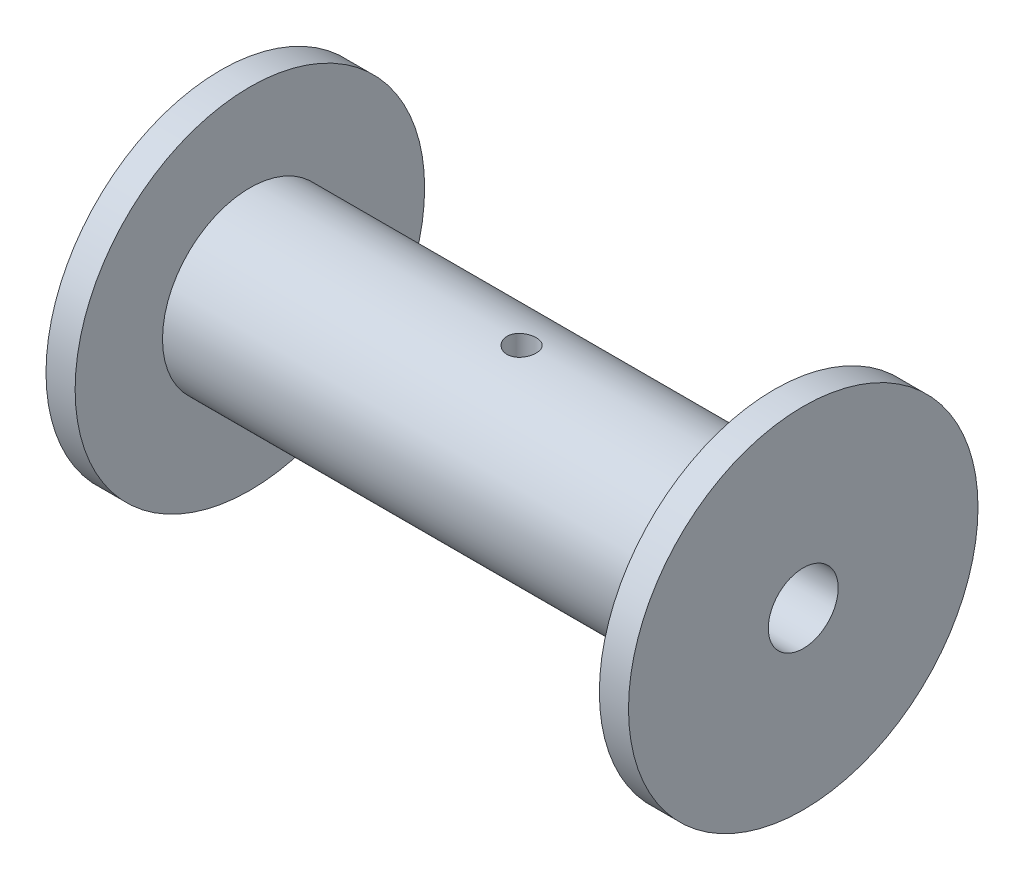
ISO-10303-21;
HEADER;
FILE_DESCRIPTION(('STEP AP214'),'2;1');
FILE_NAME('part.step','',(''),(''),'','','');
FILE_SCHEMA(('AUTOMOTIVE_DESIGN { 1 0 10303 214 1 1 1 1 }'));
ENDSEC;
DATA;
#1=APPLICATION_CONTEXT('core data for automotive mechanical design processes');
#2=APPLICATION_PROTOCOL_DEFINITION('international standard','automotive_design',2000,#1);
#3=PRODUCT_CONTEXT('',#1,'mechanical');
#4=PRODUCT('Part','Part','',(#3));
#5=PRODUCT_RELATED_PRODUCT_CATEGORY('part','',(#4));
#6=PRODUCT_DEFINITION_FORMATION('','',#4);
#7=PRODUCT_DEFINITION_CONTEXT('part definition',#1,'design');
#8=PRODUCT_DEFINITION('design','',#6,#7);
#9=PRODUCT_DEFINITION_SHAPE('','',#8);
#10=(LENGTH_UNIT() NAMED_UNIT(*) SI_UNIT(.MILLI.,.METRE.));
#11=(NAMED_UNIT(*) PLANE_ANGLE_UNIT() SI_UNIT($,.RADIAN.));
#12=(NAMED_UNIT(*) SI_UNIT($,.STERADIAN.) SOLID_ANGLE_UNIT());
#13=UNCERTAINTY_MEASURE_WITH_UNIT(LENGTH_MEASURE(1.E-05),#10,'distance_accuracy_value','');
#14=(GEOMETRIC_REPRESENTATION_CONTEXT(3) GLOBAL_UNCERTAINTY_ASSIGNED_CONTEXT((#13)) GLOBAL_UNIT_ASSIGNED_CONTEXT((#10,
#11,#12)) REPRESENTATION_CONTEXT('',''));
#15=CARTESIAN_POINT('',(0.,0.,0.));
#16=DIRECTION('',(0.,0.,1.));
#17=DIRECTION('',(1.,0.,0.));
#18=AXIS2_PLACEMENT_3D('',#15,#16,#17);
#19=CARTESIAN_POINT('',(3.175,0.,0.));
#20=DIRECTION('',(1.,0.,0.));
#21=DIRECTION('',(0.,0.,-1.));
#22=AXIS2_PLACEMENT_3D('',#19,#20,#21);
#23=PLANE('',#22);
#24=CARTESIAN_POINT('',(3.175,0.,0.));
#25=DIRECTION('',(1.,0.,0.));
#26=DIRECTION('',(0.,0.,-1.));
#27=AXIS2_PLACEMENT_3D('',#24,#25,#26);
#28=CIRCLE('',#27,19.05);
#29=CARTESIAN_POINT('',(3.175,0.,-19.05));
#30=VERTEX_POINT('',#29);
#31=EDGE_CURVE('E10',#30,#30,#28,.T.);
#32=ORIENTED_EDGE('',*,*,#31,.T.);
#33=EDGE_LOOP('',(#32));
#34=FACE_BOUND('',#33,.T.);
#35=CARTESIAN_POINT('',(3.175,0.,0.));
#36=DIRECTION('',(1.,0.,0.));
#37=DIRECTION('',(0.,0.,-1.));
#38=AXIS2_PLACEMENT_3D('',#35,#36,#37);
#39=CIRCLE('',#38,9.525);
#40=CARTESIAN_POINT('',(3.175,0.,-9.525));
#41=VERTEX_POINT('',#40);
#42=EDGE_CURVE('E51',#41,#41,#39,.T.);
#43=ORIENTED_EDGE('',*,*,#42,.F.);
#44=EDGE_LOOP('',(#43));
#45=FACE_BOUND('',#44,.T.);
#46=ADVANCED_FACE('F31',(#34,#45),#23,.T.);
#47=CARTESIAN_POINT('',(3.175,0.,0.));
#48=DIRECTION('',(-1.,0.,0.));
#49=DIRECTION('',(0.,0.,1.));
#50=AXIS2_PLACEMENT_3D('',#47,#48,#49);
#51=CYLINDRICAL_SURFACE('',#50,19.05);
#52=ORIENTED_EDGE('',*,*,#31,.F.);
#53=EDGE_LOOP('',(#52));
#54=FACE_BOUND('',#53,.T.);
#55=CARTESIAN_POINT('',(0.,0.,0.));
#56=DIRECTION('',(1.,0.,0.));
#57=DIRECTION('',(0.,0.,-1.));
#58=AXIS2_PLACEMENT_3D('',#55,#56,#57);
#59=CIRCLE('',#58,19.05);
#60=CARTESIAN_POINT('',(0.,0.,-19.05));
#61=VERTEX_POINT('',#60);
#62=EDGE_CURVE('E43',#61,#61,#59,.T.);
#63=ORIENTED_EDGE('',*,*,#62,.T.);
#64=EDGE_LOOP('',(#63));
#65=FACE_BOUND('',#64,.T.);
#66=ADVANCED_FACE('F33',(#54,#65),#51,.T.);
#67=CARTESIAN_POINT('',(0.,0.,0.));
#68=DIRECTION('',(1.,0.,0.));
#69=DIRECTION('',(0.,0.,-1.));
#70=AXIS2_PLACEMENT_3D('',#67,#68,#69);
#71=PLANE('',#70);
#72=CARTESIAN_POINT('',(0.,0.,0.));
#73=DIRECTION('',(1.,0.,0.));
#74=DIRECTION('',(0.,0.,-1.));
#75=AXIS2_PLACEMENT_3D('',#72,#73,#74);
#76=CIRCLE('',#75,3.81);
#77=CARTESIAN_POINT('',(0.,0.,-3.81));
#78=VERTEX_POINT('',#77);
#79=EDGE_CURVE('E136',#78,#78,#76,.F.);
#80=ORIENTED_EDGE('',*,*,#79,.F.);
#81=EDGE_LOOP('',(#80));
#82=FACE_BOUND('',#81,.T.);
#83=ORIENTED_EDGE('',*,*,#62,.F.);
#84=EDGE_LOOP('',(#83));
#85=FACE_BOUND('',#84,.T.);
#86=ADVANCED_FACE('F88',(#82,#85),#71,.F.);
#87=CARTESIAN_POINT('',(60.325,0.,0.));
#88=DIRECTION('',(-1.,0.,0.));
#89=DIRECTION('',(0.,0.,1.));
#90=AXIS2_PLACEMENT_3D('',#87,#88,#89);
#91=CYLINDRICAL_SURFACE('',#90,9.525);
#92=CARTESIAN_POINT('',(32.7989893337044,-9.39177665567064,1.5875));
#93=CARTESIAN_POINT('',(32.8874929337864,-9.39177825326248,1.58749644299619));
#94=CARTESIAN_POINT('',(32.9760448635596,-9.3930412366421,1.58007378233285));
#95=CARTESIAN_POINT('',(33.1506641086767,-9.39795210322439,1.55059216682225));
#96=CARTESIAN_POINT('',(33.2367290562408,-9.40160218575056,1.52851971429599));
#97=CARTESIAN_POINT('',(33.4038219336263,-9.41086261948129,1.47042476023073));
#98=CARTESIAN_POINT('',(33.4848540076049,-9.41647133201814,1.4344139173818));
#99=CARTESIAN_POINT('',(33.6397172399502,-9.42901512784981,1.34949342552482));
#100=CARTESIAN_POINT('',(33.713549207386,-9.43595006185844,1.30058522807335));
#101=CARTESIAN_POINT('',(33.8526529932922,-9.45044129183976,1.19074407962375));
#102=CARTESIAN_POINT('',(33.9178435421346,-9.45800253003243,1.12970884607204));
#103=CARTESIAN_POINT('',(34.0371080835616,-9.4728505022455,0.9975672229815));
#104=CARTESIAN_POINT('',(34.0911814172827,-9.48013721997552,0.926460236960232));
#105=CARTESIAN_POINT('',(34.1869815838886,-9.49366742984018,0.775667022417206));
#106=CARTESIAN_POINT('',(34.2286327836141,-9.49990443444536,0.695932111725009));
#107=CARTESIAN_POINT('',(34.2979202134913,-9.51057747967753,0.530476219794654));
#108=CARTESIAN_POINT('',(34.3255573549113,-9.51501363740138,0.444755628189647));
#109=CARTESIAN_POINT('',(34.3657835934192,-9.52155026549992,0.270601266228592));
#110=CARTESIAN_POINT('',(34.3785092353674,-9.52367191725427,0.182199843041336));
#111=CARTESIAN_POINT('',(34.3889758375913,-9.52541325382663,0.00449280630888134));
#112=CARTESIAN_POINT('',(34.3867178163864,-9.5250331087051,-0.0848127453658495));
#113=CARTESIAN_POINT('',(34.367387675484,-9.52183045103933,-0.260859387525085));
#114=CARTESIAN_POINT('',(34.3504625049396,-9.51903216644672,-0.347617116994588));
#115=CARTESIAN_POINT('',(34.3025099015579,-9.51133466519989,-0.517043657053486));
#116=CARTESIAN_POINT('',(34.2714820392151,-9.50643538455889,-0.599712343023703));
#117=CARTESIAN_POINT('',(34.1960587771042,-9.49504513555093,-0.75905115384198));
#118=CARTESIAN_POINT('',(34.1516028260321,-9.48854698252569,-0.835692082117093));
#119=CARTESIAN_POINT('',(34.0506296913311,-9.47468093675401,-0.980481611452617));
#120=CARTESIAN_POINT('',(33.994111531523,-9.46731297363651,-1.04862952447658));
#121=CARTESIAN_POINT('',(33.8698032915011,-9.45242120327699,-1.17536675863863));
#122=CARTESIAN_POINT('',(33.8018847784423,-9.44489658979212,-1.23383008393079));
#123=CARTESIAN_POINT('',(33.6571365314174,-9.43062604463351,-1.33855116366452));
#124=CARTESIAN_POINT('',(33.5803067152608,-9.42388012014291,-1.38480880551808));
#125=CARTESIAN_POINT('',(33.4197706411122,-9.41193034146754,-1.46383021590006));
#126=CARTESIAN_POINT('',(33.3360567774159,-9.40672822297152,-1.49657881232232));
#127=CARTESIAN_POINT('',(33.1642101727891,-9.39848379818074,-1.54751396796792));
#128=CARTESIAN_POINT('',(33.0760778216698,-9.39544130171584,-1.56570180938765));
#129=CARTESIAN_POINT('',(32.8990233245414,-9.39189739233044,-1.58682174689833));
#130=CARTESIAN_POINT('',(32.8101231825936,-9.39136606456755,-1.5899334520244));
#131=CARTESIAN_POINT('',(32.6330722971807,-9.39282497086799,-1.58129141620336));
#132=CARTESIAN_POINT('',(32.544921524903,-9.39481510753727,-1.56953824942666));
#133=CARTESIAN_POINT('',(32.3724422066182,-9.40106506533936,-1.53165323267934));
#134=CARTESIAN_POINT('',(32.2880930098819,-9.40531044968151,-1.50561280706045));
#135=CARTESIAN_POINT('',(32.1249557781169,-9.41558043858494,-1.4399883507721));
#136=CARTESIAN_POINT('',(32.0461680761096,-9.42160514958018,-1.4004035098941));
#137=CARTESIAN_POINT('',(31.8955909662565,-9.43482446532345,-1.30838998750056));
#138=CARTESIAN_POINT('',(31.8238728100043,-9.4420293480622,-1.2558462082412));
#139=CARTESIAN_POINT('',(31.6902072404431,-9.45676713341715,-1.13956431072457));
#140=CARTESIAN_POINT('',(31.6282605149497,-9.46430005907685,-1.07582540510387));
#141=CARTESIAN_POINT('',(31.5152403818217,-9.47893978045098,-0.938166824658797));
#142=CARTESIAN_POINT('',(31.4642867540137,-9.48604132978867,-0.864148165900237));
#143=CARTESIAN_POINT('',(31.3755382010563,-9.49893396394918,-0.708497089447822));
#144=CARTESIAN_POINT('',(31.3377428502635,-9.50472509115935,-0.626864918143846));
#145=CARTESIAN_POINT('',(31.2765701128931,-9.51432157437685,-0.45865989770334));
#146=CARTESIAN_POINT('',(31.2531300456127,-9.5181355520044,-0.372110357252656));
#147=CARTESIAN_POINT('',(31.2211314283624,-9.52338445312494,-0.196234516645125));
#148=CARTESIAN_POINT('',(31.2125716539094,-9.52481957237113,-0.106908445581732));
#149=CARTESIAN_POINT('',(31.2106118384362,-9.52514629058769,0.0708287101162861));
#150=CARTESIAN_POINT('',(31.2170295474518,-9.52406846785392,0.1592377819827));
#151=CARTESIAN_POINT('',(31.2444483243455,-9.51955283275925,0.333700103689827));
#152=CARTESIAN_POINT('',(31.265449310563,-9.51611503361327,0.419753366719313));
#153=CARTESIAN_POINT('',(31.3213685688247,-9.50726437905516,0.586991743158305));
#154=CARTESIAN_POINT('',(31.356271345518,-9.50185372321384,0.668182161317806));
#155=CARTESIAN_POINT('',(31.4389831232106,-9.48964800617121,0.823582587643549));
#156=CARTESIAN_POINT('',(31.4867927360181,-9.4828528793471,0.897792264684589));
#157=CARTESIAN_POINT('',(31.5946071174178,-9.46853344808037,1.03804272040974));
#158=CARTESIAN_POINT('',(31.654745339975,-9.46100168089678,1.10398015843456));
#159=CARTESIAN_POINT('',(31.7852298092197,-9.44610952598556,1.22489206122701));
#160=CARTESIAN_POINT('',(31.8555784436005,-9.43874917881281,1.27986395455526));
#161=CARTESIAN_POINT('',(32.0050776134968,-9.42497698166868,1.37764156203395));
#162=CARTESIAN_POINT('',(32.0842868895017,-9.41857220917545,1.42035846807501));
#163=CARTESIAN_POINT('',(32.2488311985081,-9.40751998491362,1.49181473064001));
#164=CARTESIAN_POINT('',(32.3341600136165,-9.40287077864066,1.52056805057216));
#165=CARTESIAN_POINT('',(32.4830157273224,-9.39688712970569,1.55703654373249));
#166=CARTESIAN_POINT('',(32.5456413567589,-9.39498135867758,1.5684420102204));
#167=CARTESIAN_POINT('',(32.6718327965776,-9.39242555911528,1.58367494744106));
#168=CARTESIAN_POINT('',(32.7353985898708,-9.39177550778453,1.58750255574369));
#169=CARTESIAN_POINT('',(32.7989893337044,-9.39177665567064,1.5875));
#170=B_SPLINE_CURVE_WITH_KNOTS('',3,(#92,#93,#94,#95,#96,#97,#98,#99,#100,#101,#102,#103,#104,
#105,#106,#107,#108,#109,#110,#111,#112,#113,#114,#115,#116,#117,#118,#119,#120,#121,#122,#123,
#124,#125,#126,#127,#128,#129,#130,#131,#132,#133,#134,#135,#136,#137,#138,#139,#140,#141,#142,
#143,#144,#145,#146,#147,#148,#149,#150,#151,#152,#153,#154,#155,#156,#157,#158,#159,#160,#161,
#162,#163,#164,#165,#166,#167,#168,#169),.UNSPECIFIED.,.T.,.F.,(4,2,2,2,2,2,2,2,2,2,2,2,2,2,2,2,
2,2,2,2,2,2,2,2,2,2,2,2,2,2,2,2,2,2,2,2,2,2,4),(0.,0.265278259719115,0.530801275176486,
0.796102673650746,1.06137422602348,1.32898616063879,1.59661395074874,1.86583942370761,
2.13504738795557,2.40177045345079,2.66847538854459,2.93253871939564,3.19661009298453,
3.46189048628535,3.72719235653995,3.99571288398448,4.26423588823722,4.53305965686614,
4.80185975070679,5.06744949436961,5.33302897967874,5.59692851043536,5.86084383006419,
6.12719337654314,6.39356166313487,6.66270011777467,6.93182986552703,7.19977595105205,
7.46769998654342,7.73238087928856,7.99706028993952,8.2614455029361,8.52584325049132,
8.79327043389165,9.0607602558995,9.33014217036923,9.59925414881157,9.78986275793718,
9.98046790668583),.UNSPECIFIED.);
#171=CARTESIAN_POINT('',(32.7989893337044,-9.39177665567064,1.5875));
#172=VERTEX_POINT('',#171);
#173=EDGE_CURVE('E78',#172,#172,#170,.T.);
#174=ORIENTED_EDGE('',*,*,#173,.T.);
#175=EDGE_LOOP('',(#174));
#176=FACE_BOUND('',#175,.T.);
#177=CARTESIAN_POINT('',(32.7989893337044,9.39177665567064,1.5875));
#178=CARTESIAN_POINT('',(32.7104857336224,9.39177825326247,1.58749644299619));
#179=CARTESIAN_POINT('',(32.6219338038492,9.3930412366421,1.58007378233285));
#180=CARTESIAN_POINT('',(32.4473145587321,9.39795210322439,1.55059216682225));
#181=CARTESIAN_POINT('',(32.361249611168,9.40160218575056,1.52851971429599));
#182=CARTESIAN_POINT('',(32.1941567337825,9.41086261948129,1.47042476023073));
#183=CARTESIAN_POINT('',(32.1131246598039,9.41647133201814,1.4344139173818));
#184=CARTESIAN_POINT('',(31.9582614274586,9.42901512784981,1.34949342552482));
#185=CARTESIAN_POINT('',(31.8844294600228,9.43595006185844,1.30058522807335));
#186=CARTESIAN_POINT('',(31.7453256741166,9.45044129183976,1.19074407962375));
#187=CARTESIAN_POINT('',(31.6801351252742,9.45800253003243,1.12970884607204));
#188=CARTESIAN_POINT('',(31.5608705838471,9.4728505022455,0.997567222981501));
#189=CARTESIAN_POINT('',(31.5067972501261,9.48013721997552,0.926460236960234));
#190=CARTESIAN_POINT('',(31.4109970835202,9.49366742984018,0.775667022417208));
#191=CARTESIAN_POINT('',(31.3693458837947,9.49990443444536,0.695932111725011));
#192=CARTESIAN_POINT('',(31.3000584539175,9.51057747967753,0.530476219794658));
#193=CARTESIAN_POINT('',(31.2724213124975,9.51501363740138,0.444755628189651));
#194=CARTESIAN_POINT('',(31.2321950739896,9.52155026549992,0.270601266228596));
#195=CARTESIAN_POINT('',(31.2194694320414,9.52367191725427,0.182199843041339));
#196=CARTESIAN_POINT('',(31.2090028298175,9.52541325382663,0.00449280630888299));
#197=CARTESIAN_POINT('',(31.2112608510224,9.5250331087051,-0.0848127453658485));
#198=CARTESIAN_POINT('',(31.2305909919248,9.52183045103933,-0.260859387525084));
#199=CARTESIAN_POINT('',(31.2475161624692,9.51903216644672,-0.347617116994588));
#200=CARTESIAN_POINT('',(31.2954687658509,9.51133466519989,-0.517043657053486));
#201=CARTESIAN_POINT('',(31.3264966281937,9.50643538455889,-0.599712343023703));
#202=CARTESIAN_POINT('',(31.4019198903046,9.49504513555093,-0.75905115384198));
#203=CARTESIAN_POINT('',(31.4463758413767,9.48854698252569,-0.835692082117093));
#204=CARTESIAN_POINT('',(31.5473489760777,9.47468093675401,-0.980481611452618));
#205=CARTESIAN_POINT('',(31.6038671358858,9.46731297363651,-1.04862952447658));
#206=CARTESIAN_POINT('',(31.7281753759077,9.45242120327699,-1.17536675863863));
#207=CARTESIAN_POINT('',(31.7960938889665,9.44489658979212,-1.23383008393079));
#208=CARTESIAN_POINT('',(31.9408421359914,9.43062604463351,-1.33855116366452));
#209=CARTESIAN_POINT('',(32.017671952148,9.42388012014291,-1.38480880551808));
#210=CARTESIAN_POINT('',(32.1782080262966,9.41193034146754,-1.46383021590006));
#211=CARTESIAN_POINT('',(32.2619218899929,9.40672822297152,-1.49657881232232));
#212=CARTESIAN_POINT('',(32.4337684946197,9.39848379818073,-1.54751396796792));
#213=CARTESIAN_POINT('',(32.521900845739,9.39544130171584,-1.56570180938765));
#214=CARTESIAN_POINT('',(32.6989553428674,9.39189739233044,-1.58682174689833));
#215=CARTESIAN_POINT('',(32.7878554848152,9.39136606456755,-1.5899334520244));
#216=CARTESIAN_POINT('',(32.9649063702281,9.39282497086799,-1.58129141620336));
#217=CARTESIAN_POINT('',(33.0530571425058,9.39481510753727,-1.56953824942666));
#218=CARTESIAN_POINT('',(33.2255364607906,9.40106506533936,-1.53165323267934));
#219=CARTESIAN_POINT('',(33.3098856575269,9.40531044968151,-1.50561280706045));
#220=CARTESIAN_POINT('',(33.4730228892919,9.41558043858494,-1.4399883507721));
#221=CARTESIAN_POINT('',(33.5518105912992,9.42160514958018,-1.4004035098941));
#222=CARTESIAN_POINT('',(33.7023877011523,9.43482446532345,-1.30838998750056));
#223=CARTESIAN_POINT('',(33.7741058574045,9.4420293480622,-1.2558462082412));
#224=CARTESIAN_POINT('',(33.9077714269657,9.45676713341715,-1.13956431072457));
#225=CARTESIAN_POINT('',(33.9697181524591,9.46430005907685,-1.07582540510387));
#226=CARTESIAN_POINT('',(34.0827382855871,9.47893978045098,-0.938166824658799));
#227=CARTESIAN_POINT('',(34.1336919133951,9.48604132978867,-0.864148165900241));
#228=CARTESIAN_POINT('',(34.2224404663525,9.49893396394918,-0.708497089447829));
#229=CARTESIAN_POINT('',(34.2602358171453,9.50472509115934,-0.626864918143854));
#230=CARTESIAN_POINT('',(34.3214085545157,9.51432157437685,-0.458659897703348));
#231=CARTESIAN_POINT('',(34.3448486217961,9.5181355520044,-0.372110357252662));
#232=CARTESIAN_POINT('',(34.3768472390464,9.52338445312494,-0.196234516645128));
#233=CARTESIAN_POINT('',(34.3854070134994,9.52481957237113,-0.106908445581734));
#234=CARTESIAN_POINT('',(34.3873668289726,9.52514629058769,0.0708287101162856));
#235=CARTESIAN_POINT('',(34.380949119957,9.52406846785392,0.1592377819827));
#236=CARTESIAN_POINT('',(34.3535303430633,9.51955283275925,0.333700103689827));
#237=CARTESIAN_POINT('',(34.3325293568458,9.51611503361327,0.419753366719313));
#238=CARTESIAN_POINT('',(34.2766100985841,9.50726437905516,0.586991743158305));
#239=CARTESIAN_POINT('',(34.2417073218908,9.50185372321384,0.668182161317805));
#240=CARTESIAN_POINT('',(34.1589955441982,9.48964800617121,0.823582587643549));
#241=CARTESIAN_POINT('',(34.1111859313907,9.4828528793471,0.89779226468459));
#242=CARTESIAN_POINT('',(34.003371549991,9.46853344808037,1.03804272040974));
#243=CARTESIAN_POINT('',(33.9432333274338,9.46100168089678,1.10398015843456));
#244=CARTESIAN_POINT('',(33.8127488581891,9.44610952598556,1.22489206122701));
#245=CARTESIAN_POINT('',(33.7424002238083,9.43874917881281,1.27986395455526));
#246=CARTESIAN_POINT('',(33.592901053912,9.42497698166868,1.37764156203395));
#247=CARTESIAN_POINT('',(33.5136917779071,9.41857220917545,1.420358468075));
#248=CARTESIAN_POINT('',(33.3491474689007,9.40751998491362,1.49181473064));
#249=CARTESIAN_POINT('',(33.2638186537922,9.40287077864066,1.52056805057216));
#250=CARTESIAN_POINT('',(33.1149629400864,9.39688712970569,1.55703654373249));
#251=CARTESIAN_POINT('',(33.0523373106499,9.39498135867758,1.5684420102204));
#252=CARTESIAN_POINT('',(32.9261458708312,9.39242555911528,1.58367494744106));
#253=CARTESIAN_POINT('',(32.862580077538,9.39177550778453,1.58750255574369));
#254=CARTESIAN_POINT('',(32.7989893337044,9.39177665567064,1.5875));
#255=B_SPLINE_CURVE_WITH_KNOTS('',3,(#177,#178,#179,#180,#181,#182,#183,#184,#185,#186,#187,
#188,#189,#190,#191,#192,#193,#194,#195,#196,#197,#198,#199,#200,#201,#202,#203,#204,#205,#206,
#207,#208,#209,#210,#211,#212,#213,#214,#215,#216,#217,#218,#219,#220,#221,#222,#223,#224,#225,
#226,#227,#228,#229,#230,#231,#232,#233,#234,#235,#236,#237,#238,#239,#240,#241,#242,#243,#244,
#245,#246,#247,#248,#249,#250,#251,#252,#253,#254),.UNSPECIFIED.,.T.,.F.,(4,2,2,2,2,2,2,2,2,2,2,
2,2,2,2,2,2,2,2,2,2,2,2,2,2,2,2,2,2,2,2,2,2,2,2,2,2,2,4),(0.,0.265278259719115,
0.530801275176486,0.796102673650747,1.06137422602348,1.32898616063879,1.59661395074874,
1.86583942370761,2.13504738795556,2.40177045345079,2.66847538854459,2.93253871939564,
3.19661009298453,3.46189048628535,3.72719235653995,3.99571288398448,4.26423588823722,
4.53305965686614,4.80185975070679,5.06744949436961,5.33302897967874,5.59692851043536,
5.86084383006419,6.12719337654315,6.39356166313487,6.66270011777466,6.93182986552702,
7.19977595105204,7.46769998654342,7.73238087928856,7.99706028993952,8.26144550293609,
8.52584325049132,8.79327043389165,9.0607602558995,9.33014217036923,9.59925414881156,
9.78986275793718,9.98046790668582),.UNSPECIFIED.);
#256=CARTESIAN_POINT('',(32.7989893337044,9.39177665567064,1.5875));
#257=VERTEX_POINT('',#256);
#258=EDGE_CURVE('E73',#257,#257,#255,.T.);
#259=ORIENTED_EDGE('',*,*,#258,.T.);
#260=EDGE_LOOP('',(#259));
#261=FACE_BOUND('',#260,.T.);
#262=CARTESIAN_POINT('',(7.1304837068667,0.,-9.525));
#263=CARTESIAN_POINT('',(7.1304871185853,-0.0837004981113234,-9.52499861431711));
#264=CARTESIAN_POINT('',(7.13751313835444,-0.167448306518958,-9.52388519686806));
#265=CARTESIAN_POINT('',(7.16542247212508,-0.332599561301523,-9.51955073691312));
#266=CARTESIAN_POINT('',(7.18631895180134,-0.414000703578241,-9.51632769201451));
#267=CARTESIAN_POINT('',(7.24132638772974,-0.572044950152507,-9.5081358738709));
#268=CARTESIAN_POINT('',(7.2754269963718,-0.648691725845268,-9.50316846790323));
#269=CARTESIAN_POINT('',(7.35584860824515,-0.795164565043413,-9.49203563759322));
#270=CARTESIAN_POINT('',(7.40216804552167,-0.864991501003514,-9.48587036679488));
#271=CARTESIAN_POINT('',(7.5061354212393,-0.996452227925343,-9.47296735087496));
#272=CARTESIAN_POINT('',(7.56386754636909,-1.0580190504219,-9.46622557658096));
#273=CARTESIAN_POINT('',(7.68884030247964,-1.17063379829871,-9.45296062384451));
#274=CARTESIAN_POINT('',(7.75608150265143,-1.22168109355484,-9.4464374585164));
#275=CARTESIAN_POINT('',(7.89861808885094,-1.31207183149559,-9.43430924972908));
#276=CARTESIAN_POINT('',(7.97395544570634,-1.35134985011303,-9.42870941361917));
#277=CARTESIAN_POINT('',(8.13026116170326,-1.4166688586755,-9.41911731619023));
#278=CARTESIAN_POINT('',(8.21122918178265,-1.44271064488462,-9.41512495817169));
#279=CARTESIAN_POINT('',(8.37579102223541,-1.48060864099661,-9.40923968756167));
#280=CARTESIAN_POINT('',(8.45935771897775,-1.49257993540557,-9.40732975200256));
#281=CARTESIAN_POINT('',(8.62733392151832,-1.50235377921514,-9.40577398086126));
#282=CARTESIAN_POINT('',(8.71174337369733,-1.50015722436292,-9.40612800214281));
#283=CARTESIAN_POINT('',(8.87819232079705,-1.48175163550809,-9.40904458848467));
#284=CARTESIAN_POINT('',(8.96024644896555,-1.46567125735665,-9.41158687510008));
#285=CARTESIAN_POINT('',(9.12047729483564,-1.4201561039655,-9.41856183519883));
#286=CARTESIAN_POINT('',(9.19865389255228,-1.39072091576478,-9.42299456713877));
#287=CARTESIAN_POINT('',(9.34929922807934,-1.31919936399662,-9.43327314532736));
#288=CARTESIAN_POINT('',(9.42174188837998,-1.27705897322292,-9.43912500501605));
#289=CARTESIAN_POINT('',(9.55857657446896,-1.18136165190581,-9.45157821200738));
#290=CARTESIAN_POINT('',(9.62296801826955,-1.12780389680637,-9.45817961342545));
#291=CARTESIAN_POINT('',(9.74261767810249,-1.01008822398667,-9.47147747596454));
#292=CARTESIAN_POINT('',(9.79776719601145,-0.945819791083951,-9.47817418186328));
#293=CARTESIAN_POINT('',(9.89651479891012,-0.80888250531232,-9.49084054883768));
#294=CARTESIAN_POINT('',(9.94011282351139,-0.736213608530646,-9.49681020611241));
#295=CARTESIAN_POINT('',(10.0145273119783,-0.584440498538958,-9.50735704011326));
#296=CARTESIAN_POINT('',(10.0453348592606,-0.505331841798512,-9.51193324483592));
#297=CARTESIAN_POINT('',(10.0931966058815,-0.342975372732542,-9.51916958373815));
#298=CARTESIAN_POINT('',(10.1102518310758,-0.259727869636485,-9.52182986083491));
#299=CARTESIAN_POINT('',(10.1299790322478,-0.0923943864471685,-9.52491554920489));
#300=CARTESIAN_POINT('',(10.1328003504011,-0.00832642500768531,-9.52536416409759));
#301=CARTESIAN_POINT('',(10.1243768152375,0.159081599433796,-9.52403931415892));
#302=CARTESIAN_POINT('',(10.1131324433179,0.242421687248919,-9.52226592537547));
#303=CARTESIAN_POINT('',(10.0770209167363,0.405551988067925,-9.51671068202159));
#304=CARTESIAN_POINT('',(10.0522270350597,0.485358820893355,-9.51293963371883));
#305=CARTESIAN_POINT('',(9.98979793288955,0.639682902881803,-9.50381038098328));
#306=CARTESIAN_POINT('',(9.95216205682071,0.7141998817666,-9.49845209552491));
#307=CARTESIAN_POINT('',(9.86477058167078,0.856482202395853,-9.48668572902274));
#308=CARTESIAN_POINT('',(9.81492087899736,0.92418906907452,-9.48026962983753));
#309=CARTESIAN_POINT('',(9.70464712988074,1.05032944229019,-9.46712535343445));
#310=CARTESIAN_POINT('',(9.64422240236167,1.10876235108301,-9.46039715613669));
#311=CARTESIAN_POINT('',(9.51384679968758,1.21524397085514,-9.44731277923704));
#312=CARTESIAN_POINT('',(9.44381341225751,1.26319222042968,-9.44096059085153));
#313=CARTESIAN_POINT('',(9.29659864296974,1.34664370406738,-9.42941980950488));
#314=CARTESIAN_POINT('',(9.21941746943973,1.38214730069526,-9.42423118264592));
#315=CARTESIAN_POINT('',(9.06038942826916,1.4395483269152,-9.41563436232062));
#316=CARTESIAN_POINT('',(8.97856157232071,1.46149737249161,-9.41221942262095));
#317=CARTESIAN_POINT('',(8.81232280820753,1.49132974884263,-9.40753913078241));
#318=CARTESIAN_POINT('',(8.72791209889339,1.49921415967798,-9.40627361358403));
#319=CARTESIAN_POINT('',(8.55990584228779,1.50066582356633,-9.40604203614239));
#320=CARTESIAN_POINT('',(8.47631165291031,1.49439110532528,-9.40705059505186));
#321=CARTESIAN_POINT('',(8.31138366349972,1.46804261070918,-9.41119816756823));
#322=CARTESIAN_POINT('',(8.23004985830606,1.44796886584048,-9.41433717631083));
#323=CARTESIAN_POINT('',(8.07200277462594,1.39465007585422,-9.4223827495018));
#324=CARTESIAN_POINT('',(7.99528530302015,1.36141719804569,-9.42728768074878));
#325=CARTESIAN_POINT('',(7.84848919974217,1.28273942612949,-9.43831423797333));
#326=CARTESIAN_POINT('',(7.77841083901205,1.23729403391932,-9.44443591357467));
#327=CARTESIAN_POINT('',(7.64608125118121,1.13491151466284,-9.45728731406023));
#328=CARTESIAN_POINT('',(7.58392087173366,1.07785767465218,-9.46402279674515));
#329=CARTESIAN_POINT('',(7.47000125610049,0.954124388767289,-9.477295765864));
#330=CARTESIAN_POINT('',(7.41824443238426,0.887442716450961,-9.48383320607627));
#331=CARTESIAN_POINT('',(7.32631577867296,0.745865300004343,-9.49601940286327));
#332=CARTESIAN_POINT('',(7.28621660141253,0.670921895884346,-9.50166249057989));
#333=CARTESIAN_POINT('',(7.21923645560548,0.515307699315209,-9.51136881427743));
#334=CARTESIAN_POINT('',(7.19234202526258,0.434642836148077,-9.51543365833633));
#335=CARTESIAN_POINT('',(7.15852151948142,0.294697285899145,-9.5206153633723));
#336=CARTESIAN_POINT('',(7.14802374131806,0.236273187103951,-9.52225100840631));
#337=CARTESIAN_POINT('',(7.13400367672901,0.118573966053792,-9.52444380980324));
#338=CARTESIAN_POINT('',(7.13048128978419,0.0592988560747561,-9.52500098170754));
#339=CARTESIAN_POINT('',(7.1304837068667,0.,-9.525));
#340=B_SPLINE_CURVE_WITH_KNOTS('',3,(#262,#263,#264,#265,#266,#267,#268,#269,#270,#271,#272,
#273,#274,#275,#276,#277,#278,#279,#280,#281,#282,#283,#284,#285,#286,#287,#288,#289,#290,#291,
#292,#293,#294,#295,#296,#297,#298,#299,#300,#301,#302,#303,#304,#305,#306,#307,#308,#309,#310,
#311,#312,#313,#314,#315,#316,#317,#318,#319,#320,#321,#322,#323,#324,#325,#326,#327,#328,#329,
#330,#331,#332,#333,#334,#335,#336,#337,#338,#339),.UNSPECIFIED.,.T.,.F.,(4,2,2,2,2,2,2,2,2,2,2,
2,2,2,2,2,2,2,2,2,2,2,2,2,2,2,2,2,2,2,2,2,2,2,2,2,2,2,4),(0.,0.250884779703371,
0.502008037427359,0.752934895708255,1.00382961102493,1.25664920880541,1.50948394618747,
1.76369914536972,2.0178990496861,2.27000502066489,2.52209505266858,2.77187383684771,
3.0216603452795,3.27252438923043,3.52340655659147,3.77705891841041,4.03071260623701,
4.28454282710605,4.53835411173862,4.78949678743544,5.04063086802688,5.29042011575275,
5.54022211696382,5.79201287313087,6.0438198516481,6.29794303737635,6.55205881881951,
6.80520085726934,7.0583234554314,7.30863496636871,7.55894590578939,7.80902593902253,
8.05911617362772,8.31185752670771,8.56465742026869,8.81900060168474,9.07308394757001,
9.25082954253662,9.42857257607496),.UNSPECIFIED.);
#341=CARTESIAN_POINT('',(7.1304837068667,0.,-9.525));
#342=VERTEX_POINT('',#341);
#343=EDGE_CURVE('E95',#342,#342,#340,.T.);
#344=ORIENTED_EDGE('',*,*,#343,.T.);
#345=EDGE_LOOP('',(#344));
#346=FACE_BOUND('',#345,.T.);
#347=CARTESIAN_POINT('',(60.325,0.,0.));
#348=DIRECTION('',(1.,0.,0.));
#349=DIRECTION('',(0.,0.,-1.));
#350=AXIS2_PLACEMENT_3D('',#347,#348,#349);
#351=CIRCLE('',#350,9.525);
#352=CARTESIAN_POINT('',(60.325,0.,-9.525));
#353=VERTEX_POINT('',#352);
#354=EDGE_CURVE('E48',#353,#353,#351,.T.);
#355=ORIENTED_EDGE('',*,*,#354,.F.);
#356=EDGE_LOOP('',(#355));
#357=FACE_BOUND('',#356,.T.);
#358=ORIENTED_EDGE('',*,*,#42,.T.);
#359=EDGE_LOOP('',(#358));
#360=FACE_BOUND('',#359,.T.);
#361=ADVANCED_FACE('F82',(#176,#261,#346,#357,#360),#91,.T.);
#362=CARTESIAN_POINT('',(60.325,0.,0.));
#363=DIRECTION('',(1.,0.,0.));
#364=DIRECTION('',(0.,0.,-1.));
#365=AXIS2_PLACEMENT_3D('',#362,#363,#364);
#366=PLANE('',#365);
#367=CARTESIAN_POINT('',(60.325,0.,0.));
#368=DIRECTION('',(1.,0.,0.));
#369=DIRECTION('',(0.,0.,-1.));
#370=AXIS2_PLACEMENT_3D('',#367,#368,#369);
#371=CIRCLE('',#370,19.05);
#372=CARTESIAN_POINT('',(60.325,0.,-19.05));
#373=VERTEX_POINT('',#372);
#374=EDGE_CURVE('E131',#373,#373,#371,.T.);
#375=ORIENTED_EDGE('',*,*,#374,.F.);
#376=EDGE_LOOP('',(#375));
#377=FACE_BOUND('',#376,.T.);
#378=ORIENTED_EDGE('',*,*,#354,.T.);
#379=EDGE_LOOP('',(#378));
#380=FACE_BOUND('',#379,.T.);
#381=ADVANCED_FACE('F87',(#377,#380),#366,.F.);
#382=CARTESIAN_POINT('',(63.5,0.,0.));
#383=DIRECTION('',(-1.,0.,0.));
#384=DIRECTION('',(0.,0.,1.));
#385=AXIS2_PLACEMENT_3D('',#382,#383,#384);
#386=CYLINDRICAL_SURFACE('',#385,19.05);
#387=CARTESIAN_POINT('',(63.5,0.,0.));
#388=DIRECTION('',(1.,0.,0.));
#389=DIRECTION('',(0.,0.,-1.));
#390=AXIS2_PLACEMENT_3D('',#387,#388,#389);
#391=CIRCLE('',#390,19.05);
#392=CARTESIAN_POINT('',(63.5,0.,-19.05));
#393=VERTEX_POINT('',#392);
#394=EDGE_CURVE('E128',#393,#393,#391,.T.);
#395=ORIENTED_EDGE('',*,*,#394,.F.);
#396=EDGE_LOOP('',(#395));
#397=FACE_BOUND('',#396,.T.);
#398=ORIENTED_EDGE('',*,*,#374,.T.);
#399=EDGE_LOOP('',(#398));
#400=FACE_BOUND('',#399,.T.);
#401=ADVANCED_FACE('F90',(#397,#400),#386,.T.);
#402=CARTESIAN_POINT('',(63.5,0.,0.));
#403=DIRECTION('',(1.,0.,0.));
#404=DIRECTION('',(0.,0.,-1.));
#405=AXIS2_PLACEMENT_3D('',#402,#403,#404);
#406=PLANE('',#405);
#407=CARTESIAN_POINT('',(63.5,0.,0.));
#408=DIRECTION('',(1.,0.,0.));
#409=DIRECTION('',(0.,0.,-1.));
#410=AXIS2_PLACEMENT_3D('',#407,#408,#409);
#411=CIRCLE('',#410,3.81);
#412=CARTESIAN_POINT('',(63.5,0.,-3.81));
#413=VERTEX_POINT('',#412);
#414=EDGE_CURVE('E100',#413,#413,#411,.T.);
#415=ORIENTED_EDGE('',*,*,#414,.F.);
#416=EDGE_LOOP('',(#415));
#417=FACE_BOUND('',#416,.T.);
#418=ORIENTED_EDGE('',*,*,#394,.T.);
#419=EDGE_LOOP('',(#418));
#420=FACE_BOUND('',#419,.T.);
#421=ADVANCED_FACE('F115',(#417,#420),#406,.T.);
#422=CARTESIAN_POINT('',(-10.776307345283,0.,0.));
#423=DIRECTION('',(1.,0.,0.));
#424=DIRECTION('',(0.,0.,-1.));
#425=AXIS2_PLACEMENT_3D('',#422,#423,#424);
#426=CYLINDRICAL_SURFACE('',#425,3.81);
#427=CARTESIAN_POINT('',(32.7989893337044,-3.46351609639684,1.5875));
#428=CARTESIAN_POINT('',(32.7143160322654,-3.46352519845289,1.58749059014541));
#429=CARTESIAN_POINT('',(32.6295044595351,-3.46666641608688,1.58068268929508));
#430=CARTESIAN_POINT('',(32.4623289172918,-3.47883268736623,1.55371392263686));
#431=CARTESIAN_POINT('',(32.3799722308269,-3.48787371796819,1.53351679584161));
#432=CARTESIAN_POINT('',(32.2204266989967,-3.51062185319955,1.48069285292702));
#433=CARTESIAN_POINT('',(32.1432182757863,-3.52430991304522,1.44811670537913));
#434=CARTESIAN_POINT('',(31.9953848327403,-3.55478268678557,1.37160809948167));
#435=CARTESIAN_POINT('',(31.9247582609443,-3.57156666788595,1.32767832751244));
#436=CARTESIAN_POINT('',(31.7876556629881,-3.60750818527218,1.22678683099873));
#437=CARTESIAN_POINT('',(31.7216387340994,-3.62674621460515,1.1692296124942));
#438=CARTESIAN_POINT('',(31.5998550511325,-3.66476655122728,1.04396752819685));
#439=CARTESIAN_POINT('',(31.5440922491259,-3.68354868039602,0.976258768044983));
#440=CARTESIAN_POINT('',(31.4420584294877,-3.71951933171879,0.829009510122631));
#441=CARTESIAN_POINT('',(31.3963040161033,-3.73660339768619,0.749083202978247));
#442=CARTESIAN_POINT('',(31.3190887876623,-3.76626780391651,0.581827668400189));
#443=CARTESIAN_POINT('',(31.2876216275098,-3.77885014290889,0.494501747687598));
#444=CARTESIAN_POINT('',(31.2415382210833,-3.79752251723806,0.31974599249196));
#445=CARTESIAN_POINT('',(31.2261302811788,-3.80391633331882,0.232558051769022));
#446=CARTESIAN_POINT('',(31.2100445294314,-3.81059472336229,0.056615559063558));
#447=CARTESIAN_POINT('',(31.209360742733,-3.81088177536389,-0.0321383428409352));
#448=CARTESIAN_POINT('',(31.2223278704897,-3.80549313998982,-0.202936830742961));
#449=CARTESIAN_POINT('',(31.2351089213721,-3.80017927603803,-0.285061010531289));
#450=CARTESIAN_POINT('',(31.2731517740549,-3.78468276272892,-0.445875275292949));
#451=CARTESIAN_POINT('',(31.2984144959347,-3.77449975444713,-0.524565106639742));
#452=CARTESIAN_POINT('',(31.3610039456406,-3.75005412565816,-0.677720409958456));
#453=CARTESIAN_POINT('',(31.3985088515503,-3.73573163350128,-0.752103114885131));
#454=CARTESIAN_POINT('',(31.4843434447138,-3.70440856767052,-0.893713944448094));
#455=CARTESIAN_POINT('',(31.5326769575775,-3.68740704816144,-0.960939528151357));
#456=CARTESIAN_POINT('',(31.6427590076183,-3.65101757446867,-1.09136295786906));
#457=CARTESIAN_POINT('',(31.7052129986287,-3.63154587832132,-1.15394287539163));
#458=CARTESIAN_POINT('',(31.8397728634018,-3.59331083065467,-1.26800789695814));
#459=CARTESIAN_POINT('',(31.9118824443354,-3.5745477547684,-1.31948871969688));
#460=CARTESIAN_POINT('',(32.066701030265,-3.5392564769128,-1.4114804034758));
#461=CARTESIAN_POINT('',(32.1496805049984,-3.52282199367027,-1.45157511761536));
#462=CARTESIAN_POINT('',(32.322080260822,-3.49516502160684,-1.51696968714157));
#463=CARTESIAN_POINT('',(32.4114958850067,-3.48393880724934,-1.54228012126687));
#464=CARTESIAN_POINT('',(32.5880382810252,-3.46889339900049,-1.57581631963514));
#465=CARTESIAN_POINT('',(32.6749371589734,-3.46464088880338,-1.5850440058374));
#466=CARTESIAN_POINT('',(32.849127006367,-3.46278564249515,-1.58909550759128));
#467=CARTESIAN_POINT('',(32.9364178297279,-3.46518060581135,-1.58392430634049));
#468=CARTESIAN_POINT('',(33.1030252832011,-3.47590276809101,-1.56023916508256));
#469=CARTESIAN_POINT('',(33.1824946459236,-3.48384035281104,-1.54260065898921));
#470=CARTESIAN_POINT('',(33.3372804802567,-3.50425550477757,-1.49564164376566));
#471=CARTESIAN_POINT('',(33.4125959764794,-3.51673413314404,-1.46631840407468));
#472=CARTESIAN_POINT('',(33.5605007778571,-3.5454691327839,-1.39544451422587));
#473=CARTESIAN_POINT('',(33.6328395514595,-3.56186310996898,-1.35342862798871));
#474=CARTESIAN_POINT('',(33.7697875603782,-3.59638604750808,-1.25882499617018));
#475=CARTESIAN_POINT('',(33.8343934309158,-3.61451575699141,-1.2062326750025));
#476=CARTESIAN_POINT('',(33.9595155050071,-3.65224847126356,-1.08692245875869));
#477=CARTESIAN_POINT('',(34.0192706116417,-3.67185126320229,-1.01940317007927));
#478=CARTESIAN_POINT('',(34.1267391445181,-3.70895068703582,-0.874841420942997));
#479=CARTESIAN_POINT('',(34.1744516882653,-3.72644716452807,-0.797798263180644));
#480=CARTESIAN_POINT('',(34.2564284755177,-3.75747599513775,-0.635831444620297));
#481=CARTESIAN_POINT('',(34.290657980142,-3.77099808586309,-0.550888115440901));
#482=CARTESIAN_POINT('',(34.3440926599691,-3.79245079841275,-0.375740720646108));
#483=CARTESIAN_POINT('',(34.3633067768515,-3.80038474770298,-0.285539820365997));
#484=CARTESIAN_POINT('',(34.3850391531152,-3.80938449192838,-0.109240997553141));
#485=CARTESIAN_POINT('',(34.3886305533195,-3.81089159758466,-0.0232969876882492));
#486=CARTESIAN_POINT('',(34.3819006442611,-3.8080889482081,0.147938250877143));
#487=CARTESIAN_POINT('',(34.3715817739681,-3.80378021290078,0.233229591377267));
#488=CARTESIAN_POINT('',(34.3380946220629,-3.79006183796803,0.397619832710464));
#489=CARTESIAN_POINT('',(34.3153951395081,-3.78083856745726,0.476831073061333));
#490=CARTESIAN_POINT('',(34.2583028397488,-3.75830464805764,0.63029113273669));
#491=CARTESIAN_POINT('',(34.22390780128,-3.74499322277742,0.704539006192));
#492=CARTESIAN_POINT('',(34.142662631602,-3.71482398256301,0.849661198158052));
#493=CARTESIAN_POINT('',(34.0953198608959,-3.69783308169732,0.920231405630386));
#494=CARTESIAN_POINT('',(33.9902402114571,-3.66231883580273,1.05272671806125));
#495=CARTESIAN_POINT('',(33.9324994740878,-3.64379492326422,1.11464859846827));
#496=CARTESIAN_POINT('',(33.8036294048693,-3.60571853479109,1.23247122978411));
#497=CARTESIAN_POINT('',(33.7318563851356,-3.58618184029528,1.28767554713356));
#498=CARTESIAN_POINT('',(33.5794567330406,-3.54959351916536,1.38535832029476));
#499=CARTESIAN_POINT('',(33.4988251856706,-3.53254328443649,1.42782966220078));
#500=CARTESIAN_POINT('',(33.3311906632255,-3.50320048320456,1.49838112875343));
#501=CARTESIAN_POINT('',(33.244224462037,-3.49088271176729,1.52653776013724));
#502=CARTESIAN_POINT('',(33.0662740749141,-3.47269819894667,1.56747916696327));
#503=CARTESIAN_POINT('',(32.975304440466,-3.46680982538325,1.58031550231937));
#504=CARTESIAN_POINT('',(32.8556840078918,-3.46386124260514,1.58674390453035));
#505=CARTESIAN_POINT('',(32.8273444238216,-3.46351304833311,1.5875031511382));
#506=CARTESIAN_POINT('',(32.7989893337044,-3.46351609639684,1.5875));
#507=B_SPLINE_CURVE_WITH_KNOTS('',3,(#427,#428,#429,#430,#431,#432,#433,#434,#435,#436,#437,
#438,#439,#440,#441,#442,#443,#444,#445,#446,#447,#448,#449,#450,#451,#452,#453,#454,#455,#456,
#457,#458,#459,#460,#461,#462,#463,#464,#465,#466,#467,#468,#469,#470,#471,#472,#473,#474,#475,
#476,#477,#478,#479,#480,#481,#482,#483,#484,#485,#486,#487,#488,#489,#490,#491,#492,#493,#494,
#495,#496,#497,#498,#499,#500,#501,#502,#503,#504,#505,#506),.UNSPECIFIED.,.T.,.F.,(4,2,2,2,2,2,
2,2,2,2,2,2,2,2,2,2,2,2,2,2,2,2,2,2,2,2,2,2,2,2,2,2,2,2,2,2,2,2,2,4),(0.,0.253938674221603,
0.508567895539564,0.762165928233184,1.01570401195863,1.28354888616931,1.55149677584086,
1.83106665253963,2.11051224804112,2.37541569591999,2.64021164765771,2.88889237111268,
3.13759142866392,3.39008484592883,3.64266760698555,3.91305455442495,4.18354561360535,
4.46292662996736,4.74210749246872,5.0031748844901,5.26415193698429,5.50842054354063,
5.75274626580183,6.00741911059075,6.2622023701024,6.53772711674102,6.8132720483317,
7.08952234563605,7.36560800996619,7.62239566569448,7.87913830318431,8.12677337096339,
8.37445549682859,8.63333125792876,8.89230328532108,9.16889742173258,9.4456458043677,
9.72089909762018,9.99522339973626,10.0802614680462),.UNSPECIFIED.);
#508=CARTESIAN_POINT('',(32.7989893337044,-3.46351609639684,1.5875));
#509=VERTEX_POINT('',#508);
#510=EDGE_CURVE('E35',#509,#509,#507,.T.);
#511=ORIENTED_EDGE('',*,*,#510,.T.);
#512=EDGE_LOOP('',(#511));
#513=FACE_BOUND('',#512,.T.);
#514=CARTESIAN_POINT('',(32.7989893337044,3.46351609639684,1.5875));
#515=CARTESIAN_POINT('',(32.8836626351434,3.46352519845288,1.58749059014541));
#516=CARTESIAN_POINT('',(32.9684742078737,3.46666641608688,1.58068268929508));
#517=CARTESIAN_POINT('',(33.135649750117,3.47883268736623,1.55371392263686));
#518=CARTESIAN_POINT('',(33.2180064365819,3.48787371796819,1.53351679584161));
#519=CARTESIAN_POINT('',(33.3775519684121,3.51062185319955,1.48069285292703));
#520=CARTESIAN_POINT('',(33.4547603916225,3.52430991304522,1.44811670537914));
#521=CARTESIAN_POINT('',(33.6025938346685,3.55478268678557,1.37160809948168));
#522=CARTESIAN_POINT('',(33.6732204064645,3.57156666788595,1.32767832751245));
#523=CARTESIAN_POINT('',(33.8103230044207,3.60750818527218,1.22678683099873));
#524=CARTESIAN_POINT('',(33.8763399333094,3.62674621460515,1.1692296124942));
#525=CARTESIAN_POINT('',(33.9981236162763,3.66476655122728,1.04396752819685));
#526=CARTESIAN_POINT('',(34.0538864182829,3.68354868039602,0.976258768044992));
#527=CARTESIAN_POINT('',(34.1559202379211,3.71951933171879,0.82900951012264));
#528=CARTESIAN_POINT('',(34.2016746513055,3.73660339768619,0.749083202978255));
#529=CARTESIAN_POINT('',(34.2788898797465,3.7662678039165,0.581827668400197));
#530=CARTESIAN_POINT('',(34.310357039899,3.77885014290889,0.494501747687607));
#531=CARTESIAN_POINT('',(34.3564404463255,3.79752251723806,0.319745992491969));
#532=CARTESIAN_POINT('',(34.37184838623,3.80391633331882,0.232558051769031));
#533=CARTESIAN_POINT('',(34.3879341379774,3.81059472336229,0.0566155590635663));
#534=CARTESIAN_POINT('',(34.3886179246758,3.81088177536389,-0.0321383428409273));
#535=CARTESIAN_POINT('',(34.3756507969191,3.80549313998982,-0.202936830742953));
#536=CARTESIAN_POINT('',(34.3628697460367,3.80017927603803,-0.285061010531281));
#537=CARTESIAN_POINT('',(34.3248268933539,3.78468276272892,-0.445875275292942));
#538=CARTESIAN_POINT('',(34.2995641714741,3.77449975444713,-0.524565106639737));
#539=CARTESIAN_POINT('',(34.2369747217682,3.75005412565817,-0.677720409958451));
#540=CARTESIAN_POINT('',(34.1994698158585,3.73573163350128,-0.752103114885123));
#541=CARTESIAN_POINT('',(34.113635222695,3.70440856767053,-0.893713944448086));
#542=CARTESIAN_POINT('',(34.0653017098313,3.68740704816144,-0.960939528151351));
#543=CARTESIAN_POINT('',(33.9552196597905,3.65101757446867,-1.09136295786906));
#544=CARTESIAN_POINT('',(33.8927656687801,3.63154587832132,-1.15394287539162));
#545=CARTESIAN_POINT('',(33.758205804007,3.59331083065467,-1.26800789695814));
#546=CARTESIAN_POINT('',(33.6860962230734,3.5745477547684,-1.31948871969687));
#547=CARTESIAN_POINT('',(33.5312776371438,3.5392564769128,-1.4114804034758));
#548=CARTESIAN_POINT('',(33.4482981624104,3.52282199367027,-1.45157511761536));
#549=CARTESIAN_POINT('',(33.2758984065868,3.49516502160684,-1.51696968714157));
#550=CARTESIAN_POINT('',(33.1864827824021,3.48393880724935,-1.54228012126687));
#551=CARTESIAN_POINT('',(33.0099403863836,3.46889339900049,-1.57581631963514));
#552=CARTESIAN_POINT('',(32.9230415084354,3.46464088880338,-1.5850440058374));
#553=CARTESIAN_POINT('',(32.7488516610418,3.46278564249515,-1.58909550759128));
#554=CARTESIAN_POINT('',(32.6615608376809,3.46518060581135,-1.58392430634049));
#555=CARTESIAN_POINT('',(32.4949533842077,3.47590276809101,-1.56023916508256));
#556=CARTESIAN_POINT('',(32.4154840214852,3.48384035281104,-1.54260065898921));
#557=CARTESIAN_POINT('',(32.2606981871521,3.50425550477757,-1.49564164376566));
#558=CARTESIAN_POINT('',(32.1853826909294,3.51673413314404,-1.46631840407469));
#559=CARTESIAN_POINT('',(32.0374778895517,3.5454691327839,-1.39544451422587));
#560=CARTESIAN_POINT('',(31.9651391159493,3.56186310996898,-1.35342862798872));
#561=CARTESIAN_POINT('',(31.8281911070306,3.59638604750808,-1.25882499617019));
#562=CARTESIAN_POINT('',(31.763585236493,3.61451575699141,-1.20623267500251));
#563=CARTESIAN_POINT('',(31.6384631624017,3.65224847126356,-1.0869224587587));
#564=CARTESIAN_POINT('',(31.5787080557671,3.67185126320229,-1.01940317007927));
#565=CARTESIAN_POINT('',(31.4712395228907,3.70895068703582,-0.874841420943003));
#566=CARTESIAN_POINT('',(31.4235269791435,3.72644716452807,-0.797798263180654));
#567=CARTESIAN_POINT('',(31.3415501918911,3.75747599513775,-0.635831444620309));
#568=CARTESIAN_POINT('',(31.3073206872668,3.77099808586309,-0.550888115440912));
#569=CARTESIAN_POINT('',(31.2538860074397,3.79245079841275,-0.375740720646118));
#570=CARTESIAN_POINT('',(31.2346718905573,3.80038474770298,-0.285539820366008));
#571=CARTESIAN_POINT('',(31.2129395142936,3.80938449192838,-0.109240997553153));
#572=CARTESIAN_POINT('',(31.2093481140893,3.81089159758466,-0.0232969876882606));
#573=CARTESIAN_POINT('',(31.2160780231477,3.8080889482081,0.147938250877133));
#574=CARTESIAN_POINT('',(31.2263968934407,3.80378021290078,0.233229591377257));
#575=CARTESIAN_POINT('',(31.2598840453459,3.79006183796803,0.397619832710456));
#576=CARTESIAN_POINT('',(31.2825835279007,3.78083856745726,0.476831073061325));
#577=CARTESIAN_POINT('',(31.33967582766,3.75830464805764,0.630291132736683));
#578=CARTESIAN_POINT('',(31.3740708661288,3.74499322277742,0.704539006191992));
#579=CARTESIAN_POINT('',(31.4553160358068,3.71482398256301,0.849661198158044));
#580=CARTESIAN_POINT('',(31.5026588065129,3.69783308169733,0.920231405630378));
#581=CARTESIAN_POINT('',(31.6077384559517,3.66231883580273,1.05272671806125));
#582=CARTESIAN_POINT('',(31.665479193321,3.64379492326423,1.11464859846827));
#583=CARTESIAN_POINT('',(31.7943492625395,3.60571853479109,1.2324712297841));
#584=CARTESIAN_POINT('',(31.8661222822732,3.58618184029528,1.28767554713355));
#585=CARTESIAN_POINT('',(32.0185219343682,3.54959351916536,1.38535832029476));
#586=CARTESIAN_POINT('',(32.0991534817382,3.53254328443649,1.42782966220078));
#587=CARTESIAN_POINT('',(32.2667880041833,3.50320048320456,1.49838112875343));
#588=CARTESIAN_POINT('',(32.3537542053718,3.49088271176729,1.52653776013724));
#589=CARTESIAN_POINT('',(32.5317045924947,3.47269819894668,1.56747916696327));
#590=CARTESIAN_POINT('',(32.6226742269427,3.46680982538326,1.58031550231936));
#591=CARTESIAN_POINT('',(32.742294659517,3.46386124260513,1.58674390453035));
#592=CARTESIAN_POINT('',(32.7706342435872,3.4635130483331,1.5875031511382));
#593=CARTESIAN_POINT('',(32.7989893337044,3.46351609639684,1.5875));
#594=B_SPLINE_CURVE_WITH_KNOTS('',3,(#514,#515,#516,#517,#518,#519,#520,#521,#522,#523,#524,
#525,#526,#527,#528,#529,#530,#531,#532,#533,#534,#535,#536,#537,#538,#539,#540,#541,#542,#543,
#544,#545,#546,#547,#548,#549,#550,#551,#552,#553,#554,#555,#556,#557,#558,#559,#560,#561,#562,
#563,#564,#565,#566,#567,#568,#569,#570,#571,#572,#573,#574,#575,#576,#577,#578,#579,#580,#581,
#582,#583,#584,#585,#586,#587,#588,#589,#590,#591,#592,#593),.UNSPECIFIED.,.T.,.F.,(4,2,2,2,2,2,
2,2,2,2,2,2,2,2,2,2,2,2,2,2,2,2,2,2,2,2,2,2,2,2,2,2,2,2,2,2,2,2,2,4),(0.,0.253938674221603,
0.508567895539557,0.762165928233169,1.01570401195862,1.2835488861693,1.55149677584085,
1.83106665253963,2.11051224804111,2.37541569591998,2.64021164765771,2.88889237111267,
3.13759142866391,3.39008484592882,3.64266760698554,3.91305455442495,4.18354561360535,
4.46292662996735,4.74210749246871,5.00317488449009,5.26415193698429,5.50842054354063,
5.75274626580182,6.00741911059073,6.2622023701024,6.53772711674101,6.81327204833169,
7.08952234563604,7.36560800996618,7.62239566569447,7.8791383031843,8.12677337096338,
8.37445549682858,8.63333125792875,8.89230328532107,9.16889742173258,9.44564580436769,
9.72089909762017,9.99522339973625,10.0802614680462),.UNSPECIFIED.);
#595=CARTESIAN_POINT('',(32.7989893337044,3.46351609639684,1.5875));
#596=VERTEX_POINT('',#595);
#597=EDGE_CURVE('E53',#596,#596,#594,.T.);
#598=ORIENTED_EDGE('',*,*,#597,.T.);
#599=EDGE_LOOP('',(#598));
#600=FACE_BOUND('',#599,.T.);
#601=CARTESIAN_POINT('',(7.1304837068667,0.,-3.81));
#602=CARTESIAN_POINT('',(7.13049194219609,-0.0807416779597111,-3.80999401605942));
#603=CARTESIAN_POINT('',(7.13704001853275,-0.16160443687296,-3.80740380796501));
#604=CARTESIAN_POINT('',(7.16300794101526,-0.321050842837931,-3.79729500626374));
#605=CARTESIAN_POINT('',(7.18246065713252,-0.399628133569204,-3.78976382783729));
#606=CARTESIAN_POINT('',(7.23342328021122,-0.551949554899342,-3.7705866912185));
#607=CARTESIAN_POINT('',(7.26489512144916,-0.625708091992756,-3.75895373259228));
#608=CARTESIAN_POINT('',(7.33885279695958,-0.7668379756879,-3.73272267824661));
#609=CARTESIAN_POINT('',(7.38133526815925,-0.834211264025619,-3.71812548821245));
#610=CARTESIAN_POINT('',(7.47816892541045,-0.963839162509436,-3.68669876909345));
#611=CARTESIAN_POINT('',(7.53294205297154,-1.02576202181957,-3.66980142618038));
#612=CARTESIAN_POINT('',(7.6519114013642,-1.13982123246012,-3.63599416193159));
#613=CARTESIAN_POINT('',(7.71611194081522,-1.19195307352911,-3.61908423838389));
#614=CARTESIAN_POINT('',(7.85545458979577,-1.28714693601368,-3.58636287059094));
#615=CARTESIAN_POINT('',(7.93094748018916,-1.32972505626879,-3.57062945811547));
#616=CARTESIAN_POINT('',(8.08873654031549,-1.40143139206191,-3.54310264598981));
#617=CARTESIAN_POINT('',(8.17102958233745,-1.43056575086726,-3.53130744741413));
#618=CARTESIAN_POINT('',(8.33627319735537,-1.47322568423285,-3.51371887327263));
#619=CARTESIAN_POINT('',(8.41903336690111,-1.487385184065,-3.50768290491928));
#620=CARTESIAN_POINT('',(8.58595817094487,-1.50167425960816,-3.50159121129678));
#621=CARTESIAN_POINT('',(8.67012212464126,-1.50181044915085,-3.50153266688769));
#622=CARTESIAN_POINT('',(8.83145088221817,-1.48853058353944,-3.50719489817321));
#623=CARTESIAN_POINT('',(8.90870662752724,-1.47602251667797,-3.51252846667967));
#624=CARTESIAN_POINT('',(9.05991819163413,-1.43931982983197,-3.52772572032585));
#625=CARTESIAN_POINT('',(9.13387345185813,-1.41512323981455,-3.5375901691054));
#626=CARTESIAN_POINT('',(9.27813510540656,-1.35527507135787,-3.56095146591443));
#627=CARTESIAN_POINT('',(9.34833859524899,-1.31940352609013,-3.57451718462248));
#628=CARTESIAN_POINT('',(9.48198190515455,-1.23737782804688,-3.60373253968475));
#629=CARTESIAN_POINT('',(9.54541922303536,-1.19121989064507,-3.6193829421926));
#630=CARTESIAN_POINT('',(9.66871439237341,-1.08587816774134,-3.65242834124126));
#631=CARTESIAN_POINT('',(9.7279511475611,-1.02597904635184,-3.66986634083479));
#632=CARTESIAN_POINT('',(9.83573396236263,-0.896907120832181,-3.70352560498016));
#633=CARTESIAN_POINT('',(9.88427802341245,-0.827732586921536,-3.71974664169737));
#634=CARTESIAN_POINT('',(9.97007832699271,-0.680357637196515,-3.74952812112635));
#635=CARTESIAN_POINT('',(10.0071078304091,-0.602013275845394,-3.76303346710702));
#636=CARTESIAN_POINT('',(10.0672497392321,-0.439541254380759,-3.78544745143041));
#637=CARTESIAN_POINT('',(10.0903689855025,-0.355416459718689,-3.79435834894765));
#638=CARTESIAN_POINT('',(10.1207940251408,-0.18898317817636,-3.8061714489718));
#639=CARTESIAN_POINT('',(10.1289349246047,-0.106849750451103,-3.8093905500312));
#640=CARTESIAN_POINT('',(10.1316292619017,0.0576643584569665,-3.81045070816835));
#641=CARTESIAN_POINT('',(10.1261860868175,0.140044972889883,-3.80829310588523));
#642=CARTESIAN_POINT('',(10.1024863853527,0.298975334452053,-3.79905023211227));
#643=CARTESIAN_POINT('',(10.084793968508,0.375623192818736,-3.79218202211051));
#644=CARTESIAN_POINT('',(10.0378591676971,0.524796057588993,-3.77443182922624));
#645=CARTESIAN_POINT('',(10.0086152935023,0.597320530662056,-3.76354932848076));
#646=CARTESIAN_POINT('',(9.93845703559714,0.73866077363068,-3.73842099904054));
#647=CARTESIAN_POINT('',(9.89721552502998,0.807297291849001,-3.72408315458266));
#648=CARTESIAN_POINT('',(9.8045972185794,0.936914300711252,-3.69360691215538));
#649=CARTESIAN_POINT('',(9.75321643409798,0.997891762929787,-3.67746780669297));
#650=CARTESIAN_POINT('',(9.63791929581027,1.11454961773784,-3.64387126798308));
#651=CARTESIAN_POINT('',(9.57341122990601,1.16964147301635,-3.62639555391229));
#652=CARTESIAN_POINT('',(9.43574700665273,1.26835541931855,-3.59306226205229));
#653=CARTESIAN_POINT('',(9.36258960947441,1.31197586308828,-3.57720491685493));
#654=CARTESIAN_POINT('',(9.20873700248984,1.38671996598729,-3.54890489581385));
#655=CARTESIAN_POINT('',(9.12798522198461,1.41773888555517,-3.53649110097095));
#656=CARTESIAN_POINT('',(8.96177082119514,1.46550744866953,-3.51696837347226));
#657=CARTESIAN_POINT('',(8.87631157368591,1.48226717053655,-3.50985569445931));
#658=CARTESIAN_POINT('',(8.70955657290144,1.50009364902934,-3.50227128274195));
#659=CARTESIAN_POINT('',(8.62838834527398,1.50217716674198,-3.50136937682112));
#660=CARTESIAN_POINT('',(8.46691864262185,1.49324544514872,-3.50518779315988));
#661=CARTESIAN_POINT('',(8.3866170666487,1.48223174840527,-3.50990745332331));
#662=CARTESIAN_POINT('',(8.23220619294982,1.44823909436334,-3.52406310534751));
#663=CARTESIAN_POINT('',(8.15797768847721,1.42571926868739,-3.53331760089948));
#664=CARTESIAN_POINT('',(8.0143194921472,1.36977659529178,-3.55537782733904));
#665=CARTESIAN_POINT('',(7.94489107302234,1.33635086922973,-3.56818449560077));
#666=CARTESIAN_POINT('',(7.80856466456033,1.25737754403329,-3.59679823826942));
#667=CARTESIAN_POINT('',(7.7420267919413,1.21125538653304,-3.61273327771081));
#668=CARTESIAN_POINT('',(7.61731156072803,1.10904780845242,-3.64540650332099));
#669=CARTESIAN_POINT('',(7.55913713458867,1.05295890859589,-3.66214496846237));
#670=CARTESIAN_POINT('',(7.44910276066872,0.928263835293592,-3.69578754618328));
#671=CARTESIAN_POINT('',(7.39785942636278,0.85909658359223,-3.71263737531029));
#672=CARTESIAN_POINT('',(7.30771715546653,0.712519684555687,-3.74352935446297));
#673=CARTESIAN_POINT('',(7.26881986209007,0.635108941870977,-3.75757113065492));
#674=CARTESIAN_POINT('',(7.20749418806593,0.481026589734811,-3.7802460313594));
#675=CARTESIAN_POINT('',(7.18394690867975,0.404851539961586,-3.7892374621479));
#676=CARTESIAN_POINT('',(7.14924708427863,0.249474795159014,-3.80261720283113));
#677=CARTESIAN_POINT('',(7.13806047257099,0.170282044229049,-3.8070181624346));
#678=CARTESIAN_POINT('',(7.13139733147533,0.0605437201930077,-3.80964102785933));
#679=CARTESIAN_POINT('',(7.13048061838913,0.0302803748639335,-3.81000224414414));
#680=CARTESIAN_POINT('',(7.1304837068667,0.,-3.81));
#681=B_SPLINE_CURVE_WITH_KNOTS('',3,(#601,#602,#603,#604,#605,#606,#607,#608,#609,#610,#611,
#612,#613,#614,#615,#616,#617,#618,#619,#620,#621,#622,#623,#624,#625,#626,#627,#628,#629,#630,
#631,#632,#633,#634,#635,#636,#637,#638,#639,#640,#641,#642,#643,#644,#645,#646,#647,#648,#649,
#650,#651,#652,#653,#654,#655,#656,#657,#658,#659,#660,#661,#662,#663,#664,#665,#666,#667,#668,
#669,#670,#671,#672,#673,#674,#675,#676,#677,#678,#679,#680),.UNSPECIFIED.,.T.,.F.,(4,2,2,2,2,2,
2,2,2,2,2,2,2,2,2,2,2,2,2,2,2,2,2,2,2,2,2,2,2,2,2,2,2,2,2,2,2,2,2,4),(0.,0.242135325293459,
0.484889784369755,0.726881708460919,0.968799805774105,1.22083171723492,1.47297944469757,
1.73592311356,1.99874650828494,2.24993425002857,2.50100352323491,2.73524003838712,
2.9695160465293,3.20848976681694,3.44755155722754,3.70446621293471,3.96142884771088,
4.22317081844922,4.48478396282567,4.73130918219005,4.97777293856057,5.21358177035677,
5.44942103328145,5.69241477863931,5.93550430436748,6.19414712825847,6.45282707208618,
6.71361512795086,6.97421870679963,7.21657269008703,7.45889813225725,7.69223214233777,
7.92562778503548,8.17210909195861,8.41867661234048,8.68055852383877,8.94247527628012,
9.18212713558917,9.42111684061079,9.51192432198794),.UNSPECIFIED.);
#682=CARTESIAN_POINT('',(7.1304837068667,0.,-3.81));
#683=VERTEX_POINT('',#682);
#684=EDGE_CURVE('E101',#683,#683,#681,.T.);
#685=ORIENTED_EDGE('',*,*,#684,.F.);
#686=EDGE_LOOP('',(#685));
#687=FACE_BOUND('',#686,.T.);
#688=ORIENTED_EDGE('',*,*,#79,.T.);
#689=EDGE_LOOP('',(#688));
#690=FACE_BOUND('',#689,.T.);
#691=ORIENTED_EDGE('',*,*,#414,.T.);
#692=EDGE_LOOP('',(#691));
#693=FACE_BOUND('',#692,.T.);
#694=ADVANCED_FACE('F57',(#513,#600,#687,#690,#693),#426,.F.);
#695=CARTESIAN_POINT('',(8.6304837068667,0.,19.051));
#696=DIRECTION('',(0.,0.,-1.));
#697=DIRECTION('',(-1.,0.,0.));
#698=AXIS2_PLACEMENT_3D('',#695,#696,#697);
#699=CYLINDRICAL_SURFACE('',#698,1.5);
#700=ORIENTED_EDGE('',*,*,#684,.T.);
#701=EDGE_LOOP('',(#700));
#702=FACE_BOUND('',#701,.T.);
#703=ORIENTED_EDGE('',*,*,#343,.F.);
#704=EDGE_LOOP('',(#703));
#705=FACE_BOUND('',#704,.T.);
#706=ADVANCED_FACE('F105',(#702,#705),#699,.F.);
#707=CARTESIAN_POINT('',(32.7989893337044,-19.05,0.));
#708=DIRECTION('',(0.,1.,0.));
#709=DIRECTION('',(0.,0.,1.));
#710=AXIS2_PLACEMENT_3D('',#707,#708,#709);
#711=CYLINDRICAL_SURFACE('',#710,1.5875);
#712=ORIENTED_EDGE('',*,*,#597,.F.);
#713=EDGE_LOOP('',(#712));
#714=FACE_BOUND('',#713,.T.);
#715=ORIENTED_EDGE('',*,*,#258,.F.);
#716=EDGE_LOOP('',(#715));
#717=FACE_BOUND('',#716,.T.);
#718=ADVANCED_FACE('F65',(#714,#717),#711,.F.);
#719=ORIENTED_EDGE('',*,*,#510,.F.);
#720=EDGE_LOOP('',(#719));
#721=FACE_BOUND('',#720,.T.);
#722=ORIENTED_EDGE('',*,*,#173,.F.);
#723=EDGE_LOOP('',(#722));
#724=FACE_BOUND('',#723,.T.);
#725=ADVANCED_FACE('F61',(#721,#724),#711,.F.);
#726=CLOSED_SHELL('',(#46,#66,#86,#361,#381,#401,#421,#694,#706,#718,#725));
#727=MANIFOLD_SOLID_BREP('B2',#726);
#728=ADVANCED_BREP_SHAPE_REPRESENTATION('',(#18,#727),#14);
#729=SHAPE_DEFINITION_REPRESENTATION(#9,#728);
ENDSEC;
END-ISO-10303-21;
